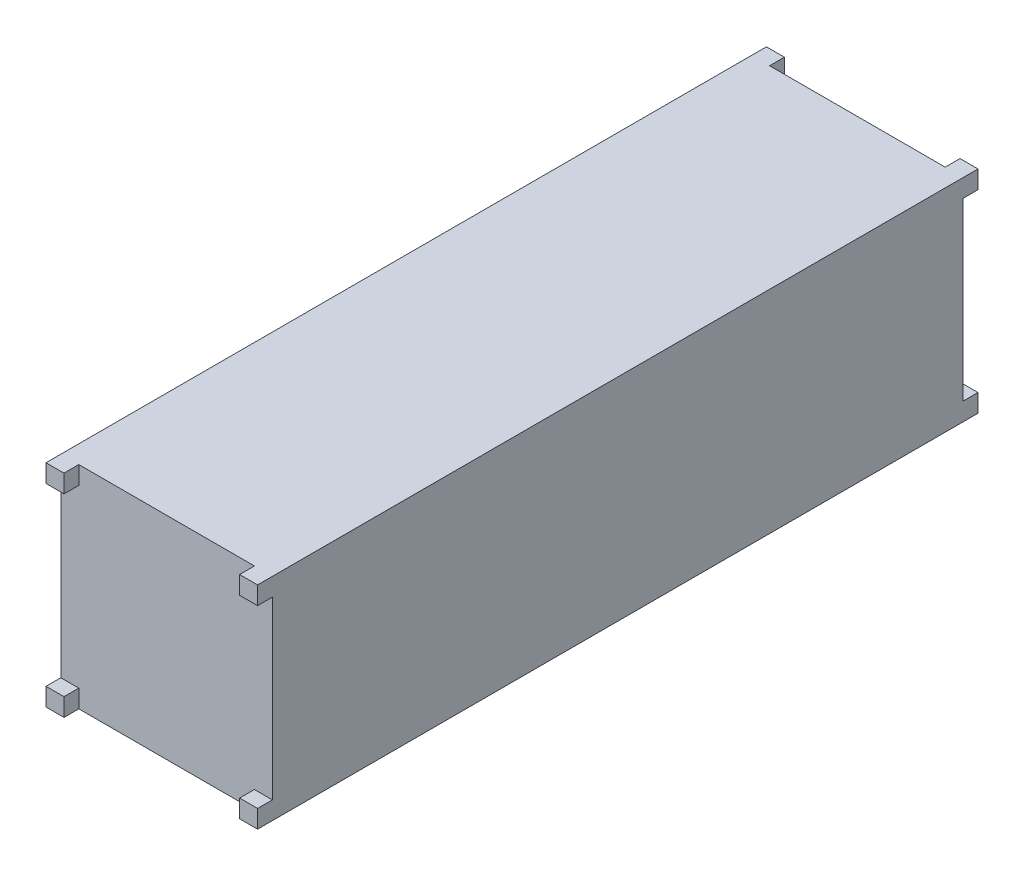
ISO-10303-21;
HEADER;
FILE_DESCRIPTION(('STEP AP214'),'2;1');
FILE_NAME('part.step','',(''),(''),'','','');
FILE_SCHEMA(('AUTOMOTIVE_DESIGN { 1 0 10303 214 1 1 1 1 }'));
ENDSEC;
DATA;
#1=APPLICATION_CONTEXT('core data for automotive mechanical design processes');
#2=APPLICATION_PROTOCOL_DEFINITION('international standard','automotive_design',2000,#1);
#3=PRODUCT_CONTEXT('',#1,'mechanical');
#4=PRODUCT('Part','Part','',(#3));
#5=PRODUCT_RELATED_PRODUCT_CATEGORY('part','',(#4));
#6=PRODUCT_DEFINITION_FORMATION('','',#4);
#7=PRODUCT_DEFINITION_CONTEXT('part definition',#1,'design');
#8=PRODUCT_DEFINITION('design','',#6,#7);
#9=PRODUCT_DEFINITION_SHAPE('','',#8);
#10=(LENGTH_UNIT() NAMED_UNIT(*) SI_UNIT(.MILLI.,.METRE.));
#11=(NAMED_UNIT(*) PLANE_ANGLE_UNIT() SI_UNIT($,.RADIAN.));
#12=(NAMED_UNIT(*) SI_UNIT($,.STERADIAN.) SOLID_ANGLE_UNIT());
#13=UNCERTAINTY_MEASURE_WITH_UNIT(LENGTH_MEASURE(1.E-05),#10,'distance_accuracy_value','');
#14=(GEOMETRIC_REPRESENTATION_CONTEXT(3) GLOBAL_UNCERTAINTY_ASSIGNED_CONTEXT((#13)) GLOBAL_UNIT_ASSIGNED_CONTEXT((#10,
#11,#12)) REPRESENTATION_CONTEXT('',''));
#15=CARTESIAN_POINT('',(0.,0.,0.));
#16=DIRECTION('',(0.,0.,1.));
#17=DIRECTION('',(1.,0.,0.));
#18=AXIS2_PLACEMENT_3D('',#15,#16,#17);
#19=CARTESIAN_POINT('',(0.,100.,0.));
#20=DIRECTION('',(-1.,0.,0.));
#21=DIRECTION('',(0.,0.,1.));
#22=AXIS2_PLACEMENT_3D('',#19,#20,#21);
#23=PLANE('',#22);
#24=DIRECTION('',(0.,-1.,0.));
#25=VECTOR('',#24,1.);
#26=CARTESIAN_POINT('',(0.,100.,0.));
#27=LINE('',#26,#25);
#28=CARTESIAN_POINT('',(0.,91.5,0.));
#29=VERTEX_POINT('',#28);
#30=CARTESIAN_POINT('',(0.,8.5,0.));
#31=VERTEX_POINT('',#30);
#32=EDGE_CURVE('E350',#29,#31,#27,.T.);
#33=ORIENTED_EDGE('',*,*,#32,.T.);
#34=DIRECTION('',(0.,0.,-1.));
#35=VECTOR('',#34,1.);
#36=CARTESIAN_POINT('',(0.,8.5,0.));
#37=LINE('',#36,#35);
#38=CARTESIAN_POINT('',(0.,8.5,-7.));
#39=VERTEX_POINT('',#38);
#40=EDGE_CURVE('E380',#31,#39,#37,.T.);
#41=ORIENTED_EDGE('',*,*,#40,.T.);
#42=DIRECTION('',(0.,-1.,0.));
#43=VECTOR('',#42,1.);
#44=CARTESIAN_POINT('',(0.,8.5,-7.));
#45=LINE('',#44,#43);
#46=CARTESIAN_POINT('',(0.,0.,-7.));
#47=VERTEX_POINT('',#46);
#48=EDGE_CURVE('E351',#39,#47,#45,.T.);
#49=ORIENTED_EDGE('',*,*,#48,.T.);
#50=DIRECTION('',(0.,0.,1.));
#51=VECTOR('',#50,1.);
#52=CARTESIAN_POINT('',(0.,0.,0.));
#53=LINE('',#52,#51);
#54=CARTESIAN_POINT('',(0.,0.,333.5));
#55=VERTEX_POINT('',#54);
#56=EDGE_CURVE('E10',#47,#55,#53,.T.);
#57=ORIENTED_EDGE('',*,*,#56,.T.);
#58=DIRECTION('',(0.,-1.,0.));
#59=VECTOR('',#58,1.);
#60=CARTESIAN_POINT('',(0.,8.5,333.5));
#61=LINE('',#60,#59);
#62=CARTESIAN_POINT('',(0.,8.5,333.5));
#63=VERTEX_POINT('',#62);
#64=EDGE_CURVE('E19',#63,#55,#61,.T.);
#65=ORIENTED_EDGE('',*,*,#64,.F.);
#66=DIRECTION('',(0.,0.,1.));
#67=VECTOR('',#66,1.);
#68=CARTESIAN_POINT('',(0.,8.5,326.5));
#69=LINE('',#68,#67);
#70=CARTESIAN_POINT('',(0.,8.5,326.5));
#71=VERTEX_POINT('',#70);
#72=EDGE_CURVE('E326',#71,#63,#69,.T.);
#73=ORIENTED_EDGE('',*,*,#72,.F.);
#74=DIRECTION('',(0.,-1.,0.));
#75=VECTOR('',#74,1.);
#76=CARTESIAN_POINT('',(0.,100.,326.5));
#77=LINE('',#76,#75);
#78=CARTESIAN_POINT('',(0.,91.5,326.5));
#79=VERTEX_POINT('',#78);
#80=EDGE_CURVE('E147',#79,#71,#77,.T.);
#81=ORIENTED_EDGE('',*,*,#80,.F.);
#82=DIRECTION('',(0.,0.,1.));
#83=VECTOR('',#82,1.);
#84=CARTESIAN_POINT('',(0.,91.5,326.5));
#85=LINE('',#84,#83);
#86=CARTESIAN_POINT('',(0.,91.5,333.5));
#87=VERTEX_POINT('',#86);
#88=EDGE_CURVE('E364',#79,#87,#85,.T.);
#89=ORIENTED_EDGE('',*,*,#88,.T.);
#90=DIRECTION('',(0.,-1.,0.));
#91=VECTOR('',#90,1.);
#92=CARTESIAN_POINT('',(0.,91.5,333.5));
#93=LINE('',#92,#91);
#94=CARTESIAN_POINT('',(0.,100.,333.5));
#95=VERTEX_POINT('',#94);
#96=EDGE_CURVE('E446',#95,#87,#93,.T.);
#97=ORIENTED_EDGE('',*,*,#96,.F.);
#98=DIRECTION('',(0.,0.,-1.));
#99=VECTOR('',#98,1.);
#100=CARTESIAN_POINT('',(0.,100.,0.));
#101=LINE('',#100,#99);
#102=CARTESIAN_POINT('',(0.,100.,-7.));
#103=VERTEX_POINT('',#102);
#104=EDGE_CURVE('E245',#95,#103,#101,.T.);
#105=ORIENTED_EDGE('',*,*,#104,.T.);
#106=DIRECTION('',(0.,-1.,0.));
#107=VECTOR('',#106,1.);
#108=CARTESIAN_POINT('',(0.,91.5,-7.));
#109=LINE('',#108,#107);
#110=CARTESIAN_POINT('',(0.,91.5,-7.));
#111=VERTEX_POINT('',#110);
#112=EDGE_CURVE('E249',#103,#111,#109,.T.);
#113=ORIENTED_EDGE('',*,*,#112,.T.);
#114=DIRECTION('',(0.,0.,-1.));
#115=VECTOR('',#114,1.);
#116=CARTESIAN_POINT('',(0.,91.5,0.));
#117=LINE('',#116,#115);
#118=EDGE_CURVE('E252',#29,#111,#117,.T.);
#119=ORIENTED_EDGE('',*,*,#118,.F.);
#120=EDGE_LOOP('',(#33,#41,#49,#57,#65,#73,#81,#89,#97,#105,#113,#119));
#121=FACE_BOUND('',#120,.T.);
#122=ADVANCED_FACE('F15',(#121),#23,.T.);
#123=CARTESIAN_POINT('',(0.,0.,0.));
#124=DIRECTION('',(0.,-1.,0.));
#125=DIRECTION('',(0.,0.,-1.));
#126=AXIS2_PLACEMENT_3D('',#123,#124,#125);
#127=PLANE('',#126);
#128=DIRECTION('',(1.,0.,0.));
#129=VECTOR('',#128,1.);
#130=CARTESIAN_POINT('',(0.,0.,0.));
#131=LINE('',#130,#129);
#132=CARTESIAN_POINT('',(8.5,0.,0.));
#133=VERTEX_POINT('',#132);
#134=CARTESIAN_POINT('',(91.5,0.,0.));
#135=VERTEX_POINT('',#134);
#136=EDGE_CURVE('E468',#133,#135,#131,.T.);
#137=ORIENTED_EDGE('',*,*,#136,.T.);
#138=DIRECTION('',(0.,0.,-1.));
#139=VECTOR('',#138,1.);
#140=CARTESIAN_POINT('',(91.5,0.,0.));
#141=LINE('',#140,#139);
#142=CARTESIAN_POINT('',(91.5,0.,-7.));
#143=VERTEX_POINT('',#142);
#144=EDGE_CURVE('E320',#135,#143,#141,.T.);
#145=ORIENTED_EDGE('',*,*,#144,.T.);
#146=DIRECTION('',(1.,0.,0.));
#147=VECTOR('',#146,1.);
#148=CARTESIAN_POINT('',(100.,0.,-7.));
#149=LINE('',#148,#147);
#150=CARTESIAN_POINT('',(100.,0.,-7.));
#151=VERTEX_POINT('',#150);
#152=EDGE_CURVE('E389',#143,#151,#149,.T.);
#153=ORIENTED_EDGE('',*,*,#152,.T.);
#154=DIRECTION('',(0.,0.,1.));
#155=VECTOR('',#154,1.);
#156=CARTESIAN_POINT('',(100.,0.,0.));
#157=LINE('',#156,#155);
#158=CARTESIAN_POINT('',(100.,0.,333.5));
#159=VERTEX_POINT('',#158);
#160=EDGE_CURVE('E26',#151,#159,#157,.T.);
#161=ORIENTED_EDGE('',*,*,#160,.T.);
#162=DIRECTION('',(1.,0.,0.));
#163=VECTOR('',#162,1.);
#164=CARTESIAN_POINT('',(100.,0.,333.5));
#165=LINE('',#164,#163);
#166=CARTESIAN_POINT('',(91.5,0.,333.5));
#167=VERTEX_POINT('',#166);
#168=EDGE_CURVE('E315',#167,#159,#165,.T.);
#169=ORIENTED_EDGE('',*,*,#168,.F.);
#170=DIRECTION('',(0.,0.,1.));
#171=VECTOR('',#170,1.);
#172=CARTESIAN_POINT('',(91.5,0.,326.5));
#173=LINE('',#172,#171);
#174=CARTESIAN_POINT('',(91.5,0.,326.5));
#175=VERTEX_POINT('',#174);
#176=EDGE_CURVE('E455',#175,#167,#173,.T.);
#177=ORIENTED_EDGE('',*,*,#176,.F.);
#178=DIRECTION('',(1.,0.,0.));
#179=VECTOR('',#178,1.);
#180=CARTESIAN_POINT('',(0.,0.,326.5));
#181=LINE('',#180,#179);
#182=CARTESIAN_POINT('',(8.5,0.,326.5));
#183=VERTEX_POINT('',#182);
#184=EDGE_CURVE('E434',#183,#175,#181,.T.);
#185=ORIENTED_EDGE('',*,*,#184,.F.);
#186=DIRECTION('',(0.,0.,1.));
#187=VECTOR('',#186,1.);
#188=CARTESIAN_POINT('',(8.5,0.,326.5));
#189=LINE('',#188,#187);
#190=CARTESIAN_POINT('',(8.5,0.,333.5));
#191=VERTEX_POINT('',#190);
#192=EDGE_CURVE('E331',#183,#191,#189,.T.);
#193=ORIENTED_EDGE('',*,*,#192,.T.);
#194=DIRECTION('',(1.,0.,0.));
#195=VECTOR('',#194,1.);
#196=CARTESIAN_POINT('',(0.,0.,333.5));
#197=LINE('',#196,#195);
#198=EDGE_CURVE('E442',#55,#191,#197,.T.);
#199=ORIENTED_EDGE('',*,*,#198,.F.);
#200=ORIENTED_EDGE('',*,*,#56,.F.);
#201=DIRECTION('',(1.,0.,0.));
#202=VECTOR('',#201,1.);
#203=CARTESIAN_POINT('',(0.,0.,-7.));
#204=LINE('',#203,#202);
#205=CARTESIAN_POINT('',(8.5,0.,-7.));
#206=VERTEX_POINT('',#205);
#207=EDGE_CURVE('E347',#47,#206,#204,.T.);
#208=ORIENTED_EDGE('',*,*,#207,.T.);
#209=DIRECTION('',(0.,0.,-1.));
#210=VECTOR('',#209,1.);
#211=CARTESIAN_POINT('',(8.5,0.,0.));
#212=LINE('',#211,#210);
#213=EDGE_CURVE('E452',#133,#206,#212,.T.);
#214=ORIENTED_EDGE('',*,*,#213,.F.);
#215=EDGE_LOOP('',(#137,#145,#153,#161,#169,#177,#185,#193,#199,#200,#208,#214));
#216=FACE_BOUND('',#215,.T.);
#217=ADVANCED_FACE('F624',(#216),#127,.T.);
#218=CARTESIAN_POINT('',(100.,0.,0.));
#219=DIRECTION('',(1.,0.,0.));
#220=DIRECTION('',(0.,1.,0.));
#221=AXIS2_PLACEMENT_3D('',#218,#219,#220);
#222=PLANE('',#221);
#223=DIRECTION('',(0.,1.,0.));
#224=VECTOR('',#223,1.);
#225=CARTESIAN_POINT('',(100.,0.,0.));
#226=LINE('',#225,#224);
#227=CARTESIAN_POINT('',(100.,8.5,0.));
#228=VERTEX_POINT('',#227);
#229=CARTESIAN_POINT('',(100.,91.5,0.));
#230=VERTEX_POINT('',#229);
#231=EDGE_CURVE('E337',#228,#230,#226,.T.);
#232=ORIENTED_EDGE('',*,*,#231,.T.);
#233=DIRECTION('',(0.,0.,-1.));
#234=VECTOR('',#233,1.);
#235=CARTESIAN_POINT('',(100.,91.5,0.));
#236=LINE('',#235,#234);
#237=CARTESIAN_POINT('',(100.,91.5,-7.));
#238=VERTEX_POINT('',#237);
#239=EDGE_CURVE('E288',#230,#238,#236,.T.);
#240=ORIENTED_EDGE('',*,*,#239,.T.);
#241=DIRECTION('',(0.,1.,0.));
#242=VECTOR('',#241,1.);
#243=CARTESIAN_POINT('',(100.,91.5,-7.));
#244=LINE('',#243,#242);
#245=CARTESIAN_POINT('',(100.,100.,-7.));
#246=VERTEX_POINT('',#245);
#247=EDGE_CURVE('E395',#238,#246,#244,.T.);
#248=ORIENTED_EDGE('',*,*,#247,.T.);
#249=DIRECTION('',(0.,0.,1.));
#250=VECTOR('',#249,1.);
#251=CARTESIAN_POINT('',(100.,100.,0.));
#252=LINE('',#251,#250);
#253=CARTESIAN_POINT('',(100.,100.,333.5));
#254=VERTEX_POINT('',#253);
#255=EDGE_CURVE('E40',#246,#254,#252,.T.);
#256=ORIENTED_EDGE('',*,*,#255,.T.);
#257=DIRECTION('',(0.,1.,0.));
#258=VECTOR('',#257,1.);
#259=CARTESIAN_POINT('',(100.,91.5,333.5));
#260=LINE('',#259,#258);
#261=CARTESIAN_POINT('',(100.,91.5,333.5));
#262=VERTEX_POINT('',#261);
#263=EDGE_CURVE('E407',#262,#254,#260,.T.);
#264=ORIENTED_EDGE('',*,*,#263,.F.);
#265=DIRECTION('',(0.,0.,1.));
#266=VECTOR('',#265,1.);
#267=CARTESIAN_POINT('',(100.,91.5,326.5));
#268=LINE('',#267,#266);
#269=CARTESIAN_POINT('',(100.,91.5,326.5));
#270=VERTEX_POINT('',#269);
#271=EDGE_CURVE('E357',#270,#262,#268,.T.);
#272=ORIENTED_EDGE('',*,*,#271,.F.);
#273=DIRECTION('',(0.,1.,0.));
#274=VECTOR('',#273,1.);
#275=CARTESIAN_POINT('',(100.,0.,326.5));
#276=LINE('',#275,#274);
#277=CARTESIAN_POINT('',(100.,8.5,326.5));
#278=VERTEX_POINT('',#277);
#279=EDGE_CURVE('E438',#278,#270,#276,.T.);
#280=ORIENTED_EDGE('',*,*,#279,.F.);
#281=DIRECTION('',(0.,0.,1.));
#282=VECTOR('',#281,1.);
#283=CARTESIAN_POINT('',(100.,8.5,326.5));
#284=LINE('',#283,#282);
#285=CARTESIAN_POINT('',(100.,8.5,333.5));
#286=VERTEX_POINT('',#285);
#287=EDGE_CURVE('E311',#278,#286,#284,.T.);
#288=ORIENTED_EDGE('',*,*,#287,.T.);
#289=DIRECTION('',(0.,1.,0.));
#290=VECTOR('',#289,1.);
#291=CARTESIAN_POINT('',(100.,8.5,333.5));
#292=LINE('',#291,#290);
#293=EDGE_CURVE('E361',#159,#286,#292,.T.);
#294=ORIENTED_EDGE('',*,*,#293,.F.);
#295=ORIENTED_EDGE('',*,*,#160,.F.);
#296=DIRECTION('',(0.,1.,0.));
#297=VECTOR('',#296,1.);
#298=CARTESIAN_POINT('',(100.,8.5,-7.));
#299=LINE('',#298,#297);
#300=CARTESIAN_POINT('',(100.,8.5,-7.));
#301=VERTEX_POINT('',#300);
#302=EDGE_CURVE('E386',#151,#301,#299,.T.);
#303=ORIENTED_EDGE('',*,*,#302,.T.);
#304=DIRECTION('',(0.,0.,-1.));
#305=VECTOR('',#304,1.);
#306=CARTESIAN_POINT('',(100.,8.5,0.));
#307=LINE('',#306,#305);
#308=EDGE_CURVE('E483',#228,#301,#307,.T.);
#309=ORIENTED_EDGE('',*,*,#308,.F.);
#310=EDGE_LOOP('',(#232,#240,#248,#256,#264,#272,#280,#288,#294,#295,#303,#309));
#311=FACE_BOUND('',#310,.T.);
#312=ADVANCED_FACE('F553',(#311),#222,.T.);
#313=CARTESIAN_POINT('',(100.,100.,0.));
#314=DIRECTION('',(0.,1.,0.));
#315=DIRECTION('',(1.,0.,0.));
#316=AXIS2_PLACEMENT_3D('',#313,#314,#315);
#317=PLANE('',#316);
#318=DIRECTION('',(-1.,0.,0.));
#319=VECTOR('',#318,1.);
#320=CARTESIAN_POINT('',(100.,100.,0.));
#321=LINE('',#320,#319);
#322=CARTESIAN_POINT('',(91.5,100.,0.));
#323=VERTEX_POINT('',#322);
#324=CARTESIAN_POINT('',(8.5,100.,0.));
#325=VERTEX_POINT('',#324);
#326=EDGE_CURVE('E355',#323,#325,#321,.T.);
#327=ORIENTED_EDGE('',*,*,#326,.T.);
#328=DIRECTION('',(0.,0.,-1.));
#329=VECTOR('',#328,1.);
#330=CARTESIAN_POINT('',(8.5,100.,0.));
#331=LINE('',#330,#329);
#332=CARTESIAN_POINT('',(8.5,100.,-7.));
#333=VERTEX_POINT('',#332);
#334=EDGE_CURVE('E272',#325,#333,#331,.T.);
#335=ORIENTED_EDGE('',*,*,#334,.T.);
#336=DIRECTION('',(-1.,0.,0.));
#337=VECTOR('',#336,1.);
#338=CARTESIAN_POINT('',(0.,100.,-7.));
#339=LINE('',#338,#337);
#340=EDGE_CURVE('E256',#333,#103,#339,.T.);
#341=ORIENTED_EDGE('',*,*,#340,.T.);
#342=ORIENTED_EDGE('',*,*,#104,.F.);
#343=DIRECTION('',(-1.,0.,0.));
#344=VECTOR('',#343,1.);
#345=CARTESIAN_POINT('',(0.,100.,333.5));
#346=LINE('',#345,#344);
#347=CARTESIAN_POINT('',(8.5,100.,333.5));
#348=VERTEX_POINT('',#347);
#349=EDGE_CURVE('E426',#348,#95,#346,.T.);
#350=ORIENTED_EDGE('',*,*,#349,.F.);
#351=DIRECTION('',(0.,0.,1.));
#352=VECTOR('',#351,1.);
#353=CARTESIAN_POINT('',(8.5,100.,326.5));
#354=LINE('',#353,#352);
#355=CARTESIAN_POINT('',(8.5,100.,326.5));
#356=VERTEX_POINT('',#355);
#357=EDGE_CURVE('E370',#356,#348,#354,.T.);
#358=ORIENTED_EDGE('',*,*,#357,.F.);
#359=DIRECTION('',(-1.,0.,0.));
#360=VECTOR('',#359,1.);
#361=CARTESIAN_POINT('',(100.,100.,326.5));
#362=LINE('',#361,#360);
#363=CARTESIAN_POINT('',(91.5,100.,326.5));
#364=VERTEX_POINT('',#363);
#365=EDGE_CURVE('E307',#364,#356,#362,.T.);
#366=ORIENTED_EDGE('',*,*,#365,.F.);
#367=DIRECTION('',(0.,0.,1.));
#368=VECTOR('',#367,1.);
#369=CARTESIAN_POINT('',(91.5,100.,326.5));
#370=LINE('',#369,#368);
#371=CARTESIAN_POINT('',(91.5,100.,333.5));
#372=VERTEX_POINT('',#371);
#373=EDGE_CURVE('E412',#364,#372,#370,.T.);
#374=ORIENTED_EDGE('',*,*,#373,.T.);
#375=DIRECTION('',(-1.,0.,0.));
#376=VECTOR('',#375,1.);
#377=CARTESIAN_POINT('',(100.,100.,333.5));
#378=LINE('',#377,#376);
#379=EDGE_CURVE('E411',#254,#372,#378,.T.);
#380=ORIENTED_EDGE('',*,*,#379,.F.);
#381=ORIENTED_EDGE('',*,*,#255,.F.);
#382=DIRECTION('',(-1.,0.,0.));
#383=VECTOR('',#382,1.);
#384=CARTESIAN_POINT('',(100.,100.,-7.));
#385=LINE('',#384,#383);
#386=CARTESIAN_POINT('',(91.5,100.,-7.));
#387=VERTEX_POINT('',#386);
#388=EDGE_CURVE('E587',#246,#387,#385,.T.);
#389=ORIENTED_EDGE('',*,*,#388,.T.);
#390=DIRECTION('',(0.,0.,-1.));
#391=VECTOR('',#390,1.);
#392=CARTESIAN_POINT('',(91.5,100.,0.));
#393=LINE('',#392,#391);
#394=EDGE_CURVE('E290',#323,#387,#393,.T.);
#395=ORIENTED_EDGE('',*,*,#394,.F.);
#396=EDGE_LOOP('',(#327,#335,#341,#342,#350,#358,#366,#374,#380,#381,#389,#395));
#397=FACE_BOUND('',#396,.T.);
#398=ADVANCED_FACE('F569',(#397),#317,.T.);
#399=CARTESIAN_POINT('',(95.75,95.75,333.5));
#400=DIRECTION('',(0.,0.,1.));
#401=DIRECTION('',(1.,0.,0.));
#402=AXIS2_PLACEMENT_3D('',#399,#400,#401);
#403=PLANE('',#402);
#404=ORIENTED_EDGE('',*,*,#263,.T.);
#405=ORIENTED_EDGE('',*,*,#379,.T.);
#406=DIRECTION('',(0.,-1.,0.));
#407=VECTOR('',#406,1.);
#408=CARTESIAN_POINT('',(91.5,100.,333.5));
#409=LINE('',#408,#407);
#410=CARTESIAN_POINT('',(91.5,91.5,333.5));
#411=VERTEX_POINT('',#410);
#412=EDGE_CURVE('E299',#372,#411,#409,.T.);
#413=ORIENTED_EDGE('',*,*,#412,.T.);
#414=DIRECTION('',(1.,0.,0.));
#415=VECTOR('',#414,1.);
#416=CARTESIAN_POINT('',(91.5,91.5,333.5));
#417=LINE('',#416,#415);
#418=EDGE_CURVE('E282',#411,#262,#417,.T.);
#419=ORIENTED_EDGE('',*,*,#418,.T.);
#420=EDGE_LOOP('',(#404,#405,#413,#419));
#421=FACE_BOUND('',#420,.T.);
#422=ADVANCED_FACE('F17',(#421),#403,.T.);
#423=CARTESIAN_POINT('',(91.5,100.,326.5));
#424=DIRECTION('',(-1.,0.,0.));
#425=DIRECTION('',(0.,0.,1.));
#426=AXIS2_PLACEMENT_3D('',#423,#424,#425);
#427=PLANE('',#426);
#428=DIRECTION('',(0.,1.,0.));
#429=VECTOR('',#428,1.);
#430=CARTESIAN_POINT('',(91.5,75.,326.5));
#431=LINE('',#430,#429);
#432=CARTESIAN_POINT('',(91.5,91.5,326.5));
#433=VERTEX_POINT('',#432);
#434=EDGE_CURVE('E310',#433,#364,#431,.T.);
#435=ORIENTED_EDGE('',*,*,#434,.F.);
#436=DIRECTION('',(0.,0.,1.));
#437=VECTOR('',#436,1.);
#438=CARTESIAN_POINT('',(91.5,91.5,326.5));
#439=LINE('',#438,#437);
#440=EDGE_CURVE('E295',#433,#411,#439,.T.);
#441=ORIENTED_EDGE('',*,*,#440,.T.);
#442=ORIENTED_EDGE('',*,*,#412,.F.);
#443=ORIENTED_EDGE('',*,*,#373,.F.);
#444=EDGE_LOOP('',(#435,#441,#442,#443));
#445=FACE_BOUND('',#444,.T.);
#446=ADVANCED_FACE('F563',(#445),#427,.T.);
#447=CARTESIAN_POINT('',(91.5,91.5,326.5));
#448=DIRECTION('',(0.,-1.,0.));
#449=DIRECTION('',(0.,0.,-1.));
#450=AXIS2_PLACEMENT_3D('',#447,#448,#449);
#451=PLANE('',#450);
#452=DIRECTION('',(-1.,0.,0.));
#453=VECTOR('',#452,1.);
#454=CARTESIAN_POINT('',(70.75,91.5,326.5));
#455=LINE('',#454,#453);
#456=EDGE_CURVE('E403',#270,#433,#455,.T.);
#457=ORIENTED_EDGE('',*,*,#456,.F.);
#458=ORIENTED_EDGE('',*,*,#271,.T.);
#459=ORIENTED_EDGE('',*,*,#418,.F.);
#460=ORIENTED_EDGE('',*,*,#440,.F.);
#461=EDGE_LOOP('',(#457,#458,#459,#460));
#462=FACE_BOUND('',#461,.T.);
#463=ADVANCED_FACE('F559',(#462),#451,.T.);
#464=CARTESIAN_POINT('',(95.75,4.25,333.5));
#465=DIRECTION('',(0.,0.,1.));
#466=DIRECTION('',(1.,0.,0.));
#467=AXIS2_PLACEMENT_3D('',#464,#465,#466);
#468=PLANE('',#467);
#469=DIRECTION('',(-1.,0.,0.));
#470=VECTOR('',#469,1.);
#471=CARTESIAN_POINT('',(91.5,8.5,333.5));
#472=LINE('',#471,#470);
#473=CARTESIAN_POINT('',(91.5,8.5,333.5));
#474=VERTEX_POINT('',#473);
#475=EDGE_CURVE('E316',#286,#474,#472,.T.);
#476=ORIENTED_EDGE('',*,*,#475,.T.);
#477=DIRECTION('',(0.,-1.,0.));
#478=VECTOR('',#477,1.);
#479=CARTESIAN_POINT('',(91.5,0.,333.5));
#480=LINE('',#479,#478);
#481=EDGE_CURVE('E459',#474,#167,#480,.T.);
#482=ORIENTED_EDGE('',*,*,#481,.T.);
#483=ORIENTED_EDGE('',*,*,#168,.T.);
#484=ORIENTED_EDGE('',*,*,#293,.T.);
#485=EDGE_LOOP('',(#476,#482,#483,#484));
#486=FACE_BOUND('',#485,.T.);
#487=ADVANCED_FACE('F616',(#486),#468,.T.);
#488=CARTESIAN_POINT('',(100.,8.5,326.5));
#489=DIRECTION('',(0.,1.,0.));
#490=DIRECTION('',(1.,0.,0.));
#491=AXIS2_PLACEMENT_3D('',#488,#489,#490);
#492=PLANE('',#491);
#493=DIRECTION('',(1.,0.,0.));
#494=VECTOR('',#493,1.);
#495=CARTESIAN_POINT('',(75.,8.5,326.5));
#496=LINE('',#495,#494);
#497=CARTESIAN_POINT('',(91.5,8.5,326.5));
#498=VERTEX_POINT('',#497);
#499=EDGE_CURVE('E433',#498,#278,#496,.T.);
#500=ORIENTED_EDGE('',*,*,#499,.F.);
#501=DIRECTION('',(0.,0.,1.));
#502=VECTOR('',#501,1.);
#503=CARTESIAN_POINT('',(91.5,8.5,326.5));
#504=LINE('',#503,#502);
#505=EDGE_CURVE('E341',#498,#474,#504,.T.);
#506=ORIENTED_EDGE('',*,*,#505,.T.);
#507=ORIENTED_EDGE('',*,*,#475,.F.);
#508=ORIENTED_EDGE('',*,*,#287,.F.);
#509=EDGE_LOOP('',(#500,#506,#507,#508));
#510=FACE_BOUND('',#509,.T.);
#511=ADVANCED_FACE('F919',(#510),#492,.T.);
#512=CARTESIAN_POINT('',(91.5,8.5,326.5));
#513=DIRECTION('',(-1.,0.,0.));
#514=DIRECTION('',(0.,0.,1.));
#515=AXIS2_PLACEMENT_3D('',#512,#513,#514);
#516=PLANE('',#515);
#517=DIRECTION('',(0.,1.,0.));
#518=VECTOR('',#517,1.);
#519=CARTESIAN_POINT('',(91.5,29.25,326.5));
#520=LINE('',#519,#518);
#521=EDGE_CURVE('E429',#175,#498,#520,.T.);
#522=ORIENTED_EDGE('',*,*,#521,.F.);
#523=ORIENTED_EDGE('',*,*,#176,.T.);
#524=ORIENTED_EDGE('',*,*,#481,.F.);
#525=ORIENTED_EDGE('',*,*,#505,.F.);
#526=EDGE_LOOP('',(#522,#523,#524,#525));
#527=FACE_BOUND('',#526,.T.);
#528=ADVANCED_FACE('F658',(#527),#516,.T.);
#529=CARTESIAN_POINT('',(50.,50.,326.5));
#530=DIRECTION('',(0.,0.,1.));
#531=DIRECTION('',(1.,0.,0.));
#532=AXIS2_PLACEMENT_3D('',#529,#530,#531);
#533=PLANE('',#532);
#534=DIRECTION('',(0.,-1.,0.));
#535=VECTOR('',#534,1.);
#536=CARTESIAN_POINT('',(8.5,25.,326.5));
#537=LINE('',#536,#535);
#538=CARTESIAN_POINT('',(8.5,8.5,326.5));
#539=VERTEX_POINT('',#538);
#540=EDGE_CURVE('E332',#539,#183,#537,.T.);
#541=ORIENTED_EDGE('',*,*,#540,.T.);
#542=ORIENTED_EDGE('',*,*,#184,.T.);
#543=ORIENTED_EDGE('',*,*,#521,.T.);
#544=ORIENTED_EDGE('',*,*,#499,.T.);
#545=ORIENTED_EDGE('',*,*,#279,.T.);
#546=ORIENTED_EDGE('',*,*,#456,.T.);
#547=ORIENTED_EDGE('',*,*,#434,.T.);
#548=ORIENTED_EDGE('',*,*,#365,.T.);
#549=DIRECTION('',(0.,-1.,0.));
#550=VECTOR('',#549,1.);
#551=CARTESIAN_POINT('',(8.5,70.75,326.5));
#552=LINE('',#551,#550);
#553=CARTESIAN_POINT('',(8.5,91.5,326.5));
#554=VERTEX_POINT('',#553);
#555=EDGE_CURVE('E375',#356,#554,#552,.T.);
#556=ORIENTED_EDGE('',*,*,#555,.T.);
#557=DIRECTION('',(-1.,0.,0.));
#558=VECTOR('',#557,1.);
#559=CARTESIAN_POINT('',(25.,91.5,326.5));
#560=LINE('',#559,#558);
#561=EDGE_CURVE('E342',#554,#79,#560,.T.);
#562=ORIENTED_EDGE('',*,*,#561,.T.);
#563=ORIENTED_EDGE('',*,*,#80,.T.);
#564=DIRECTION('',(1.,0.,0.));
#565=VECTOR('',#564,1.);
#566=CARTESIAN_POINT('',(29.25,8.5,326.5));
#567=LINE('',#566,#565);
#568=EDGE_CURVE('E423',#71,#539,#567,.T.);
#569=ORIENTED_EDGE('',*,*,#568,.T.);
#570=EDGE_LOOP('',(#541,#542,#543,#544,#545,#546,#547,#548,#556,#562,#563,#569));
#571=FACE_BOUND('',#570,.T.);
#572=ADVANCED_FACE('F550',(#571),#533,.T.);
#573=CARTESIAN_POINT('',(4.25,95.75,333.5));
#574=DIRECTION('',(0.,0.,1.));
#575=DIRECTION('',(1.,0.,0.));
#576=AXIS2_PLACEMENT_3D('',#573,#574,#575);
#577=PLANE('',#576);
#578=DIRECTION('',(1.,0.,0.));
#579=VECTOR('',#578,1.);
#580=CARTESIAN_POINT('',(8.5,91.5,333.5));
#581=LINE('',#580,#579);
#582=CARTESIAN_POINT('',(8.5,91.5,333.5));
#583=VERTEX_POINT('',#582);
#584=EDGE_CURVE('E162',#87,#583,#581,.T.);
#585=ORIENTED_EDGE('',*,*,#584,.T.);
#586=DIRECTION('',(0.,1.,0.));
#587=VECTOR('',#586,1.);
#588=CARTESIAN_POINT('',(8.5,100.,333.5));
#589=LINE('',#588,#587);
#590=EDGE_CURVE('E374',#583,#348,#589,.T.);
#591=ORIENTED_EDGE('',*,*,#590,.T.);
#592=ORIENTED_EDGE('',*,*,#349,.T.);
#593=ORIENTED_EDGE('',*,*,#96,.T.);
#594=EDGE_LOOP('',(#585,#591,#592,#593));
#595=FACE_BOUND('',#594,.T.);
#596=ADVANCED_FACE('F940',(#595),#577,.T.);
#597=CARTESIAN_POINT('',(0.,91.5,326.5));
#598=DIRECTION('',(0.,-1.,0.));
#599=DIRECTION('',(0.,0.,-1.));
#600=AXIS2_PLACEMENT_3D('',#597,#598,#599);
#601=PLANE('',#600);
#602=ORIENTED_EDGE('',*,*,#561,.F.);
#603=DIRECTION('',(0.,0.,1.));
#604=VECTOR('',#603,1.);
#605=CARTESIAN_POINT('',(8.5,91.5,326.5));
#606=LINE('',#605,#604);
#607=EDGE_CURVE('E346',#554,#583,#606,.T.);
#608=ORIENTED_EDGE('',*,*,#607,.T.);
#609=ORIENTED_EDGE('',*,*,#584,.F.);
#610=ORIENTED_EDGE('',*,*,#88,.F.);
#611=EDGE_LOOP('',(#602,#608,#609,#610));
#612=FACE_BOUND('',#611,.T.);
#613=ADVANCED_FACE('F578',(#612),#601,.T.);
#614=CARTESIAN_POINT('',(8.5,91.5,326.5));
#615=DIRECTION('',(1.,0.,0.));
#616=DIRECTION('',(0.,1.,0.));
#617=AXIS2_PLACEMENT_3D('',#614,#615,#616);
#618=PLANE('',#617);
#619=ORIENTED_EDGE('',*,*,#555,.F.);
#620=ORIENTED_EDGE('',*,*,#357,.T.);
#621=ORIENTED_EDGE('',*,*,#590,.F.);
#622=ORIENTED_EDGE('',*,*,#607,.F.);
#623=EDGE_LOOP('',(#619,#620,#621,#622));
#624=FACE_BOUND('',#623,.T.);
#625=ADVANCED_FACE('F573',(#624),#618,.T.);
#626=CARTESIAN_POINT('',(4.25,4.25,333.5));
#627=DIRECTION('',(0.,0.,1.));
#628=DIRECTION('',(1.,0.,0.));
#629=AXIS2_PLACEMENT_3D('',#626,#627,#628);
#630=PLANE('',#629);
#631=ORIENTED_EDGE('',*,*,#64,.T.);
#632=ORIENTED_EDGE('',*,*,#198,.T.);
#633=DIRECTION('',(0.,1.,0.));
#634=VECTOR('',#633,1.);
#635=CARTESIAN_POINT('',(8.5,0.,333.5));
#636=LINE('',#635,#634);
#637=CARTESIAN_POINT('',(8.5,8.5,333.5));
#638=VERTEX_POINT('',#637);
#639=EDGE_CURVE('E327',#191,#638,#636,.T.);
#640=ORIENTED_EDGE('',*,*,#639,.T.);
#641=DIRECTION('',(-1.,0.,0.));
#642=VECTOR('',#641,1.);
#643=CARTESIAN_POINT('',(8.5,8.5,333.5));
#644=LINE('',#643,#642);
#645=EDGE_CURVE('E321',#638,#63,#644,.T.);
#646=ORIENTED_EDGE('',*,*,#645,.T.);
#647=EDGE_LOOP('',(#631,#632,#640,#646));
#648=FACE_BOUND('',#647,.T.);
#649=ADVANCED_FACE('F666',(#648),#630,.T.);
#650=CARTESIAN_POINT('',(8.5,0.,326.5));
#651=DIRECTION('',(1.,0.,0.));
#652=DIRECTION('',(0.,1.,0.));
#653=AXIS2_PLACEMENT_3D('',#650,#651,#652);
#654=PLANE('',#653);
#655=ORIENTED_EDGE('',*,*,#540,.F.);
#656=DIRECTION('',(0.,0.,1.));
#657=VECTOR('',#656,1.);
#658=CARTESIAN_POINT('',(8.5,8.5,326.5));
#659=LINE('',#658,#657);
#660=EDGE_CURVE('E325',#539,#638,#659,.T.);
#661=ORIENTED_EDGE('',*,*,#660,.T.);
#662=ORIENTED_EDGE('',*,*,#639,.F.);
#663=ORIENTED_EDGE('',*,*,#192,.F.);
#664=EDGE_LOOP('',(#655,#661,#662,#663));
#665=FACE_BOUND('',#664,.T.);
#666=ADVANCED_FACE('F660',(#665),#654,.T.);
#667=CARTESIAN_POINT('',(8.5,8.5,326.5));
#668=DIRECTION('',(0.,1.,0.));
#669=DIRECTION('',(1.,0.,0.));
#670=AXIS2_PLACEMENT_3D('',#667,#668,#669);
#671=PLANE('',#670);
#672=ORIENTED_EDGE('',*,*,#568,.F.);
#673=ORIENTED_EDGE('',*,*,#72,.T.);
#674=ORIENTED_EDGE('',*,*,#645,.F.);
#675=ORIENTED_EDGE('',*,*,#660,.F.);
#676=EDGE_LOOP('',(#672,#673,#674,#675));
#677=FACE_BOUND('',#676,.T.);
#678=ADVANCED_FACE('F585',(#677),#671,.T.);
#679=CARTESIAN_POINT('',(95.75,95.75,-7.));
#680=DIRECTION('',(0.,0.,1.));
#681=DIRECTION('',(1.,0.,0.));
#682=AXIS2_PLACEMENT_3D('',#679,#680,#681);
#683=PLANE('',#682);
#684=ORIENTED_EDGE('',*,*,#247,.F.);
#685=DIRECTION('',(1.,0.,0.));
#686=VECTOR('',#685,1.);
#687=CARTESIAN_POINT('',(91.5,91.5,-7.));
#688=LINE('',#687,#686);
#689=CARTESIAN_POINT('',(91.5,91.5,-7.));
#690=VERTEX_POINT('',#689);
#691=EDGE_CURVE('E284',#690,#238,#688,.T.);
#692=ORIENTED_EDGE('',*,*,#691,.F.);
#693=DIRECTION('',(0.,-1.,0.));
#694=VECTOR('',#693,1.);
#695=CARTESIAN_POINT('',(91.5,100.,-7.));
#696=LINE('',#695,#694);
#697=EDGE_CURVE('E294',#387,#690,#696,.T.);
#698=ORIENTED_EDGE('',*,*,#697,.F.);
#699=ORIENTED_EDGE('',*,*,#388,.F.);
#700=EDGE_LOOP('',(#684,#692,#698,#699));
#701=FACE_BOUND('',#700,.T.);
#702=ADVANCED_FACE('F638',(#701),#683,.F.);
#703=CARTESIAN_POINT('',(91.5,100.,0.));
#704=DIRECTION('',(1.,0.,0.));
#705=DIRECTION('',(0.,1.,0.));
#706=AXIS2_PLACEMENT_3D('',#703,#704,#705);
#707=PLANE('',#706);
#708=DIRECTION('',(0.,-1.,0.));
#709=VECTOR('',#708,1.);
#710=CARTESIAN_POINT('',(91.5,75.,0.));
#711=LINE('',#710,#709);
#712=CARTESIAN_POINT('',(91.5,91.5,0.));
#713=VERTEX_POINT('',#712);
#714=EDGE_CURVE('E338',#323,#713,#711,.T.);
#715=ORIENTED_EDGE('',*,*,#714,.F.);
#716=ORIENTED_EDGE('',*,*,#394,.T.);
#717=ORIENTED_EDGE('',*,*,#697,.T.);
#718=DIRECTION('',(0.,0.,-1.));
#719=VECTOR('',#718,1.);
#720=CARTESIAN_POINT('',(91.5,91.5,0.));
#721=LINE('',#720,#719);
#722=EDGE_CURVE('E289',#713,#690,#721,.T.);
#723=ORIENTED_EDGE('',*,*,#722,.F.);
#724=EDGE_LOOP('',(#715,#716,#717,#723));
#725=FACE_BOUND('',#724,.T.);
#726=ADVANCED_FACE('F1024',(#725),#707,.F.);
#727=CARTESIAN_POINT('',(91.5,91.5,0.));
#728=DIRECTION('',(0.,1.,0.));
#729=DIRECTION('',(1.,0.,0.));
#730=AXIS2_PLACEMENT_3D('',#727,#728,#729);
#731=PLANE('',#730);
#732=DIRECTION('',(1.,0.,0.));
#733=VECTOR('',#732,1.);
#734=CARTESIAN_POINT('',(70.75,91.5,0.));
#735=LINE('',#734,#733);
#736=EDGE_CURVE('E333',#713,#230,#735,.T.);
#737=ORIENTED_EDGE('',*,*,#736,.F.);
#738=ORIENTED_EDGE('',*,*,#722,.T.);
#739=ORIENTED_EDGE('',*,*,#691,.T.);
#740=ORIENTED_EDGE('',*,*,#239,.F.);
#741=EDGE_LOOP('',(#737,#738,#739,#740));
#742=FACE_BOUND('',#741,.T.);
#743=ADVANCED_FACE('F634',(#742),#731,.F.);
#744=CARTESIAN_POINT('',(95.75,4.25,-7.));
#745=DIRECTION('',(0.,0.,1.));
#746=DIRECTION('',(1.,0.,0.));
#747=AXIS2_PLACEMENT_3D('',#744,#745,#746);
#748=PLANE('',#747);
#749=DIRECTION('',(-1.,0.,0.));
#750=VECTOR('',#749,1.);
#751=CARTESIAN_POINT('',(91.5,8.5,-7.));
#752=LINE('',#751,#750);
#753=CARTESIAN_POINT('',(91.5,8.5,-7.));
#754=VERTEX_POINT('',#753);
#755=EDGE_CURVE('E390',#301,#754,#752,.T.);
#756=ORIENTED_EDGE('',*,*,#755,.F.);
#757=ORIENTED_EDGE('',*,*,#302,.F.);
#758=ORIENTED_EDGE('',*,*,#152,.F.);
#759=DIRECTION('',(0.,-1.,0.));
#760=VECTOR('',#759,1.);
#761=CARTESIAN_POINT('',(91.5,0.,-7.));
#762=LINE('',#761,#760);
#763=EDGE_CURVE('E304',#754,#143,#762,.T.);
#764=ORIENTED_EDGE('',*,*,#763,.F.);
#765=EDGE_LOOP('',(#756,#757,#758,#764));
#766=FACE_BOUND('',#765,.T.);
#767=ADVANCED_FACE('F627',(#766),#748,.F.);
#768=CARTESIAN_POINT('',(100.,8.5,0.));
#769=DIRECTION('',(0.,-1.,0.));
#770=DIRECTION('',(0.,0.,-1.));
#771=AXIS2_PLACEMENT_3D('',#768,#769,#770);
#772=PLANE('',#771);
#773=DIRECTION('',(-1.,0.,0.));
#774=VECTOR('',#773,1.);
#775=CARTESIAN_POINT('',(75.,8.5,0.));
#776=LINE('',#775,#774);
#777=CARTESIAN_POINT('',(91.5,8.5,0.));
#778=VERTEX_POINT('',#777);
#779=EDGE_CURVE('E490',#228,#778,#776,.T.);
#780=ORIENTED_EDGE('',*,*,#779,.F.);
#781=ORIENTED_EDGE('',*,*,#308,.T.);
#782=ORIENTED_EDGE('',*,*,#755,.T.);
#783=DIRECTION('',(0.,0.,-1.));
#784=VECTOR('',#783,1.);
#785=CARTESIAN_POINT('',(91.5,8.5,0.));
#786=LINE('',#785,#784);
#787=EDGE_CURVE('E300',#778,#754,#786,.T.);
#788=ORIENTED_EDGE('',*,*,#787,.F.);
#789=EDGE_LOOP('',(#780,#781,#782,#788));
#790=FACE_BOUND('',#789,.T.);
#791=ADVANCED_FACE('F629',(#790),#772,.F.);
#792=CARTESIAN_POINT('',(91.5,8.5,0.));
#793=DIRECTION('',(1.,0.,0.));
#794=DIRECTION('',(0.,1.,0.));
#795=AXIS2_PLACEMENT_3D('',#792,#793,#794);
#796=PLANE('',#795);
#797=DIRECTION('',(0.,-1.,0.));
#798=VECTOR('',#797,1.);
#799=CARTESIAN_POINT('',(91.5,29.25,0.));
#800=LINE('',#799,#798);
#801=EDGE_CURVE('E471',#778,#135,#800,.T.);
#802=ORIENTED_EDGE('',*,*,#801,.F.);
#803=ORIENTED_EDGE('',*,*,#787,.T.);
#804=ORIENTED_EDGE('',*,*,#763,.T.);
#805=ORIENTED_EDGE('',*,*,#144,.F.);
#806=EDGE_LOOP('',(#802,#803,#804,#805));
#807=FACE_BOUND('',#806,.T.);
#808=ADVANCED_FACE('F1036',(#807),#796,.F.);
#809=CARTESIAN_POINT('',(4.25,95.75,-7.));
#810=DIRECTION('',(0.,0.,1.));
#811=DIRECTION('',(1.,0.,0.));
#812=AXIS2_PLACEMENT_3D('',#809,#810,#811);
#813=PLANE('',#812);
#814=DIRECTION('',(1.,0.,0.));
#815=VECTOR('',#814,1.);
#816=CARTESIAN_POINT('',(8.5,91.5,-7.));
#817=LINE('',#816,#815);
#818=CARTESIAN_POINT('',(8.5,91.5,-7.));
#819=VERTEX_POINT('',#818);
#820=EDGE_CURVE('E257',#111,#819,#817,.T.);
#821=ORIENTED_EDGE('',*,*,#820,.F.);
#822=ORIENTED_EDGE('',*,*,#112,.F.);
#823=ORIENTED_EDGE('',*,*,#340,.F.);
#824=DIRECTION('',(0.,1.,0.));
#825=VECTOR('',#824,1.);
#826=CARTESIAN_POINT('',(8.5,100.,-7.));
#827=LINE('',#826,#825);
#828=EDGE_CURVE('E262',#819,#333,#827,.T.);
#829=ORIENTED_EDGE('',*,*,#828,.F.);
#830=EDGE_LOOP('',(#821,#822,#823,#829));
#831=FACE_BOUND('',#830,.T.);
#832=ADVANCED_FACE('F260',(#831),#813,.F.);
#833=CARTESIAN_POINT('',(0.,91.5,0.));
#834=DIRECTION('',(0.,1.,0.));
#835=DIRECTION('',(1.,0.,0.));
#836=AXIS2_PLACEMENT_3D('',#833,#834,#835);
#837=PLANE('',#836);
#838=DIRECTION('',(1.,0.,0.));
#839=VECTOR('',#838,1.);
#840=CARTESIAN_POINT('',(25.,91.5,0.));
#841=LINE('',#840,#839);
#842=CARTESIAN_POINT('',(8.5,91.5,0.));
#843=VERTEX_POINT('',#842);
#844=EDGE_CURVE('E269',#29,#843,#841,.T.);
#845=ORIENTED_EDGE('',*,*,#844,.F.);
#846=ORIENTED_EDGE('',*,*,#118,.T.);
#847=ORIENTED_EDGE('',*,*,#820,.T.);
#848=DIRECTION('',(0.,0.,-1.));
#849=VECTOR('',#848,1.);
#850=CARTESIAN_POINT('',(8.5,91.5,0.));
#851=LINE('',#850,#849);
#852=EDGE_CURVE('E465',#843,#819,#851,.T.);
#853=ORIENTED_EDGE('',*,*,#852,.F.);
#854=EDGE_LOOP('',(#845,#846,#847,#853));
#855=FACE_BOUND('',#854,.T.);
#856=ADVANCED_FACE('F267',(#855),#837,.F.);
#857=CARTESIAN_POINT('',(8.5,91.5,0.));
#858=DIRECTION('',(-1.,0.,0.));
#859=DIRECTION('',(0.,0.,1.));
#860=AXIS2_PLACEMENT_3D('',#857,#858,#859);
#861=PLANE('',#860);
#862=DIRECTION('',(0.,1.,0.));
#863=VECTOR('',#862,1.);
#864=CARTESIAN_POINT('',(8.5,70.75,0.));
#865=LINE('',#864,#863);
#866=EDGE_CURVE('E352',#843,#325,#865,.T.);
#867=ORIENTED_EDGE('',*,*,#866,.F.);
#868=ORIENTED_EDGE('',*,*,#852,.T.);
#869=ORIENTED_EDGE('',*,*,#828,.T.);
#870=ORIENTED_EDGE('',*,*,#334,.F.);
#871=EDGE_LOOP('',(#867,#868,#869,#870));
#872=FACE_BOUND('',#871,.T.);
#873=ADVANCED_FACE('F948',(#872),#861,.F.);
#874=CARTESIAN_POINT('',(50.,50.,0.));
#875=DIRECTION('',(0.,0.,1.));
#876=DIRECTION('',(1.,0.,0.));
#877=AXIS2_PLACEMENT_3D('',#874,#875,#876);
#878=PLANE('',#877);
#879=DIRECTION('',(0.,1.,0.));
#880=VECTOR('',#879,1.);
#881=CARTESIAN_POINT('',(8.5,25.,0.));
#882=LINE('',#881,#880);
#883=CARTESIAN_POINT('',(8.5,8.5,0.));
#884=VERTEX_POINT('',#883);
#885=EDGE_CURVE('E399',#133,#884,#882,.T.);
#886=ORIENTED_EDGE('',*,*,#885,.T.);
#887=DIRECTION('',(-1.,0.,0.));
#888=VECTOR('',#887,1.);
#889=CARTESIAN_POINT('',(29.25,8.5,0.));
#890=LINE('',#889,#888);
#891=EDGE_CURVE('E494',#884,#31,#890,.T.);
#892=ORIENTED_EDGE('',*,*,#891,.T.);
#893=ORIENTED_EDGE('',*,*,#32,.F.);
#894=ORIENTED_EDGE('',*,*,#844,.T.);
#895=ORIENTED_EDGE('',*,*,#866,.T.);
#896=ORIENTED_EDGE('',*,*,#326,.F.);
#897=ORIENTED_EDGE('',*,*,#714,.T.);
#898=ORIENTED_EDGE('',*,*,#736,.T.);
#899=ORIENTED_EDGE('',*,*,#231,.F.);
#900=ORIENTED_EDGE('',*,*,#779,.T.);
#901=ORIENTED_EDGE('',*,*,#801,.T.);
#902=ORIENTED_EDGE('',*,*,#136,.F.);
#903=EDGE_LOOP('',(#886,#892,#893,#894,#895,#896,#897,#898,#899,#900,#901,#902));
#904=FACE_BOUND('',#903,.T.);
#905=ADVANCED_FACE('F532',(#904),#878,.F.);
#906=CARTESIAN_POINT('',(4.25,4.25,-7.));
#907=DIRECTION('',(0.,0.,1.));
#908=DIRECTION('',(1.,0.,0.));
#909=AXIS2_PLACEMENT_3D('',#906,#907,#908);
#910=PLANE('',#909);
#911=ORIENTED_EDGE('',*,*,#48,.F.);
#912=DIRECTION('',(-1.,0.,0.));
#913=VECTOR('',#912,1.);
#914=CARTESIAN_POINT('',(8.5,8.5,-7.));
#915=LINE('',#914,#913);
#916=CARTESIAN_POINT('',(8.5,8.5,-7.));
#917=VERTEX_POINT('',#916);
#918=EDGE_CURVE('E376',#917,#39,#915,.T.);
#919=ORIENTED_EDGE('',*,*,#918,.F.);
#920=DIRECTION('',(0.,1.,0.));
#921=VECTOR('',#920,1.);
#922=CARTESIAN_POINT('',(8.5,0.,-7.));
#923=LINE('',#922,#921);
#924=EDGE_CURVE('E385',#206,#917,#923,.T.);
#925=ORIENTED_EDGE('',*,*,#924,.F.);
#926=ORIENTED_EDGE('',*,*,#207,.F.);
#927=EDGE_LOOP('',(#911,#919,#925,#926));
#928=FACE_BOUND('',#927,.T.);
#929=ADVANCED_FACE('F957',(#928),#910,.F.);
#930=CARTESIAN_POINT('',(8.5,0.,0.));
#931=DIRECTION('',(-1.,0.,0.));
#932=DIRECTION('',(0.,0.,1.));
#933=AXIS2_PLACEMENT_3D('',#930,#931,#932);
#934=PLANE('',#933);
#935=ORIENTED_EDGE('',*,*,#885,.F.);
#936=ORIENTED_EDGE('',*,*,#213,.T.);
#937=ORIENTED_EDGE('',*,*,#924,.T.);
#938=DIRECTION('',(0.,0.,-1.));
#939=VECTOR('',#938,1.);
#940=CARTESIAN_POINT('',(8.5,8.5,0.));
#941=LINE('',#940,#939);
#942=EDGE_CURVE('E381',#884,#917,#941,.T.);
#943=ORIENTED_EDGE('',*,*,#942,.F.);
#944=EDGE_LOOP('',(#935,#936,#937,#943));
#945=FACE_BOUND('',#944,.T.);
#946=ADVANCED_FACE('F953',(#945),#934,.F.);
#947=CARTESIAN_POINT('',(8.5,8.5,0.));
#948=DIRECTION('',(0.,-1.,0.));
#949=DIRECTION('',(0.,0.,-1.));
#950=AXIS2_PLACEMENT_3D('',#947,#948,#949);
#951=PLANE('',#950);
#952=ORIENTED_EDGE('',*,*,#891,.F.);
#953=ORIENTED_EDGE('',*,*,#942,.T.);
#954=ORIENTED_EDGE('',*,*,#918,.T.);
#955=ORIENTED_EDGE('',*,*,#40,.F.);
#956=EDGE_LOOP('',(#952,#953,#954,#955));
#957=FACE_BOUND('',#956,.T.);
#958=ADVANCED_FACE('F530',(#957),#951,.F.);
#959=CLOSED_SHELL('',(#122,#217,#312,#398,#422,#446,#463,#487,#511,#528,#572,#596,#613,#625,
#649,#666,#678,#702,#726,#743,#767,#791,#808,#832,#856,#873,#905,#929,#946,#958));
#960=MANIFOLD_SOLID_BREP('B1',#959);
#961=ADVANCED_BREP_SHAPE_REPRESENTATION('',(#18,#960),#14);
#962=SHAPE_DEFINITION_REPRESENTATION(#9,#961);
ENDSEC;
END-ISO-10303-21;
